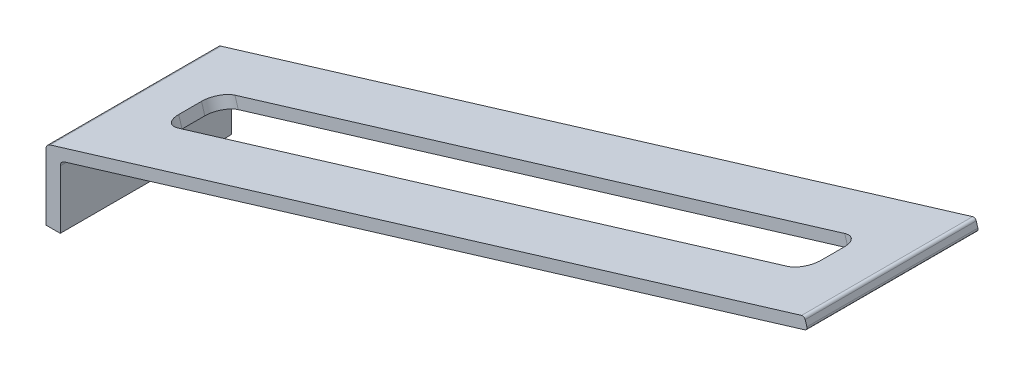
ISO-10303-21;
HEADER;
FILE_DESCRIPTION(('STEP AP214'),'2;1');
FILE_NAME('part.step','',(''),(''),'','','');
FILE_SCHEMA(('AUTOMOTIVE_DESIGN { 1 0 10303 214 1 1 1 1 }'));
ENDSEC;
DATA;
#1=APPLICATION_CONTEXT('core data for automotive mechanical design processes');
#2=APPLICATION_PROTOCOL_DEFINITION('international standard','automotive_design',2000,#1);
#3=PRODUCT_CONTEXT('',#1,'mechanical');
#4=PRODUCT('Part','Part','',(#3));
#5=PRODUCT_RELATED_PRODUCT_CATEGORY('part','',(#4));
#6=PRODUCT_DEFINITION_FORMATION('','',#4);
#7=PRODUCT_DEFINITION_CONTEXT('part definition',#1,'design');
#8=PRODUCT_DEFINITION('design','',#6,#7);
#9=PRODUCT_DEFINITION_SHAPE('','',#8);
#10=(LENGTH_UNIT() NAMED_UNIT(*) SI_UNIT(.MILLI.,.METRE.));
#11=(NAMED_UNIT(*) PLANE_ANGLE_UNIT() SI_UNIT($,.RADIAN.));
#12=(NAMED_UNIT(*) SI_UNIT($,.STERADIAN.) SOLID_ANGLE_UNIT());
#13=UNCERTAINTY_MEASURE_WITH_UNIT(LENGTH_MEASURE(1.E-05),#10,'distance_accuracy_value','');
#14=(GEOMETRIC_REPRESENTATION_CONTEXT(3) GLOBAL_UNCERTAINTY_ASSIGNED_CONTEXT((#13)) GLOBAL_UNIT_ASSIGNED_CONTEXT((#10,
#11,#12)) REPRESENTATION_CONTEXT('',''));
#15=CARTESIAN_POINT('',(0.,0.,0.));
#16=DIRECTION('',(0.,0.,1.));
#17=DIRECTION('',(1.,0.,0.));
#18=AXIS2_PLACEMENT_3D('',#15,#16,#17);
#19=CARTESIAN_POINT('',(-3.6,-1.16697015505413,3.));
#20=DIRECTION('',(1.,0.,0.));
#21=DIRECTION('',(0.,0.,-1.));
#22=AXIS2_PLACEMENT_3D('',#19,#20,#21);
#23=PLANE('',#22);
#24=DIRECTION('',(0.,1.,0.));
#25=VECTOR('',#24,1.);
#26=CARTESIAN_POINT('',(-3.6,-1.16697015505413,3.));
#27=LINE('',#26,#25);
#28=CARTESIAN_POINT('',(-3.6,-1.16697015505413,3.));
#29=VERTEX_POINT('',#28);
#30=CARTESIAN_POINT('',(-3.6,-2.19282032302755,3.));
#31=VERTEX_POINT('',#30);
#32=EDGE_CURVE('E111',#29,#31,#27,.F.);
#33=ORIENTED_EDGE('',*,*,#32,.T.);
#34=DIRECTION('',(0.,0.,1.));
#35=VECTOR('',#34,1.);
#36=CARTESIAN_POINT('',(-3.6,-2.19282032302755,3.));
#37=LINE('',#36,#35);
#38=CARTESIAN_POINT('',(-3.6,-2.19282032302755,0.));
#39=VERTEX_POINT('',#38);
#40=EDGE_CURVE('E219',#31,#39,#37,.F.);
#41=ORIENTED_EDGE('',*,*,#40,.T.);
#42=DIRECTION('',(0.,1.,0.));
#43=VECTOR('',#42,1.);
#44=CARTESIAN_POINT('',(-3.6,-1.16697015505413,0.));
#45=LINE('',#44,#43);
#46=CARTESIAN_POINT('',(-3.6,-1.16697015505413,0.));
#47=VERTEX_POINT('',#46);
#48=EDGE_CURVE('E225',#39,#47,#45,.T.);
#49=ORIENTED_EDGE('',*,*,#48,.T.);
#50=DIRECTION('',(0.,0.,-1.));
#51=VECTOR('',#50,1.);
#52=CARTESIAN_POINT('',(-3.6,-1.16697015505413,3.));
#53=LINE('',#52,#51);
#54=EDGE_CURVE('E211',#47,#29,#53,.F.);
#55=ORIENTED_EDGE('',*,*,#54,.T.);
#56=EDGE_LOOP('',(#33,#41,#49,#55));
#57=FACE_BOUND('',#56,.T.);
#58=ADVANCED_FACE('F17',(#57),#23,.T.);
#59=CARTESIAN_POINT('',(-3.85,-2.19282032302755,3.));
#60=DIRECTION('',(0.,1.,0.));
#61=DIRECTION('',(0.,0.,1.));
#62=AXIS2_PLACEMENT_3D('',#59,#60,#61);
#63=PLANE('',#62);
#64=ORIENTED_EDGE('',*,*,#40,.F.);
#65=DIRECTION('',(1.,0.,0.));
#66=VECTOR('',#65,1.);
#67=CARTESIAN_POINT('',(-3.85,-2.19282032302755,3.));
#68=LINE('',#67,#66);
#69=CARTESIAN_POINT('',(-3.85,-2.19282032302755,3.));
#70=VERTEX_POINT('',#69);
#71=EDGE_CURVE('E230',#70,#31,#68,.T.);
#72=ORIENTED_EDGE('',*,*,#71,.F.);
#73=DIRECTION('',(0.,0.,-1.));
#74=VECTOR('',#73,1.);
#75=CARTESIAN_POINT('',(-3.85,-2.19282032302755,3.));
#76=LINE('',#75,#74);
#77=CARTESIAN_POINT('',(-3.85,-2.19282032302755,0.));
#78=VERTEX_POINT('',#77);
#79=EDGE_CURVE('E289',#70,#78,#76,.T.);
#80=ORIENTED_EDGE('',*,*,#79,.T.);
#81=DIRECTION('',(1.,0.,0.));
#82=VECTOR('',#81,1.);
#83=CARTESIAN_POINT('',(-3.85,-2.19282032302755,0.));
#84=LINE('',#83,#82);
#85=EDGE_CURVE('E215',#39,#78,#84,.F.);
#86=ORIENTED_EDGE('',*,*,#85,.F.);
#87=EDGE_LOOP('',(#64,#72,#80,#86));
#88=FACE_BOUND('',#87,.T.);
#89=ADVANCED_FACE('F309',(#88),#63,.F.);
#90=CARTESIAN_POINT('',(-3.5,-1.16697015505413,3.));
#91=DIRECTION('',(0.,0.,-1.));
#92=DIRECTION('',(-1.,0.,0.));
#93=AXIS2_PLACEMENT_3D('',#90,#91,#92);
#94=CYLINDRICAL_SURFACE('',#93,0.0999999999999998);
#95=DIRECTION('',(0.,0.,1.));
#96=VECTOR('',#95,1.);
#97=CARTESIAN_POINT('',(-3.52904726426677,-1.07128182536542,3.));
#98=LINE('',#97,#96);
#99=CARTESIAN_POINT('',(-3.52904726426677,-1.07128182536542,0.));
#100=VERTEX_POINT('',#99);
#101=CARTESIAN_POINT('',(-3.52904726426677,-1.07128182536542,3.));
#102=VERTEX_POINT('',#101);
#103=EDGE_CURVE('E287',#100,#102,#98,.T.);
#104=ORIENTED_EDGE('',*,*,#103,.T.);
#105=CARTESIAN_POINT('',(-3.5,-1.16697015505413,3.));
#106=DIRECTION('',(0.,0.,-1.));
#107=DIRECTION('',(-1.,0.,0.));
#108=AXIS2_PLACEMENT_3D('',#105,#106,#107);
#109=CIRCLE('',#108,0.0999999999999998);
#110=EDGE_CURVE('E20',#29,#102,#109,.T.);
#111=ORIENTED_EDGE('',*,*,#110,.F.);
#112=ORIENTED_EDGE('',*,*,#54,.F.);
#113=CARTESIAN_POINT('',(-3.5,-1.16697015505413,0.));
#114=DIRECTION('',(0.,0.,-1.));
#115=DIRECTION('',(-1.,0.,0.));
#116=AXIS2_PLACEMENT_3D('',#113,#114,#115);
#117=CIRCLE('',#116,0.0999999999999998);
#118=EDGE_CURVE('E206',#100,#47,#117,.F.);
#119=ORIENTED_EDGE('',*,*,#118,.F.);
#120=EDGE_LOOP('',(#104,#111,#112,#119));
#121=FACE_BOUND('',#120,.T.);
#122=ADVANCED_FACE('F336',(#121),#94,.F.);
#123=CARTESIAN_POINT('',(9.44837064336018,2.92041171454448,3.));
#124=DIRECTION('',(0.,0.,-1.));
#125=DIRECTION('',(-1.,0.,0.));
#126=AXIS2_PLACEMENT_3D('',#123,#124,#125);
#127=CYLINDRICAL_SURFACE('',#126,0.0499999999999997);
#128=CARTESIAN_POINT('',(9.44837064336018,2.92041171454448,3.));
#129=DIRECTION('',(0.,0.,-1.));
#130=DIRECTION('',(-1.,0.,0.));
#131=AXIS2_PLACEMENT_3D('',#128,#129,#130);
#132=CIRCLE('',#131,0.0499999999999997);
#133=CARTESIAN_POINT('',(9.49621480820454,2.93493534667787,3.));
#134=VERTEX_POINT('',#133);
#135=CARTESIAN_POINT('',(9.46289427549357,2.87256754970012,3.));
#136=VERTEX_POINT('',#135);
#137=EDGE_CURVE('E203',#134,#136,#132,.T.);
#138=ORIENTED_EDGE('',*,*,#137,.T.);
#139=DIRECTION('',(0.,0.,1.));
#140=VECTOR('',#139,1.);
#141=CARTESIAN_POINT('',(9.46289427549357,2.87256754970012,3.));
#142=LINE('',#141,#140);
#143=CARTESIAN_POINT('',(9.46289427549357,2.87256754970012,0.));
#144=VERTEX_POINT('',#143);
#145=EDGE_CURVE('E286',#136,#144,#142,.F.);
#146=ORIENTED_EDGE('',*,*,#145,.T.);
#147=CARTESIAN_POINT('',(9.44837064336018,2.92041171454448,0.));
#148=DIRECTION('',(0.,0.,-1.));
#149=DIRECTION('',(-1.,0.,0.));
#150=AXIS2_PLACEMENT_3D('',#147,#148,#149);
#151=CIRCLE('',#150,0.0499999999999997);
#152=CARTESIAN_POINT('',(9.49621480820454,2.93493534667787,0.));
#153=VERTEX_POINT('',#152);
#154=EDGE_CURVE('E205',#144,#153,#151,.F.);
#155=ORIENTED_EDGE('',*,*,#154,.T.);
#156=DIRECTION('',(0.,0.,1.));
#157=VECTOR('',#156,1.);
#158=CARTESIAN_POINT('',(9.49621480820454,2.93493534667787,3.));
#159=LINE('',#158,#157);
#160=EDGE_CURVE('E202',#153,#134,#159,.T.);
#161=ORIENTED_EDGE('',*,*,#160,.T.);
#162=EDGE_LOOP('',(#138,#146,#155,#161));
#163=FACE_BOUND('',#162,.T.);
#164=ADVANCED_FACE('F329',(#163),#127,.T.);
#165=CARTESIAN_POINT('',(-3.85,-1.03384855104302,3.));
#166=DIRECTION('',(1.,0.,0.));
#167=DIRECTION('',(0.,0.,-1.));
#168=AXIS2_PLACEMENT_3D('',#165,#166,#167);
#169=PLANE('',#168);
#170=ORIENTED_EDGE('',*,*,#79,.F.);
#171=DIRECTION('',(0.,1.,0.));
#172=VECTOR('',#171,1.);
#173=CARTESIAN_POINT('',(-3.85,-1.03384855104302,3.));
#174=LINE('',#173,#172);
#175=CARTESIAN_POINT('',(-3.85,-1.03384855104302,3.));
#176=VERTEX_POINT('',#175);
#177=EDGE_CURVE('E116',#176,#70,#174,.F.);
#178=ORIENTED_EDGE('',*,*,#177,.F.);
#179=DIRECTION('',(0.,0.,-1.));
#180=VECTOR('',#179,1.);
#181=CARTESIAN_POINT('',(-3.85,-1.03384855104302,3.));
#182=LINE('',#181,#180);
#183=CARTESIAN_POINT('',(-3.85,-1.03384855104302,0.));
#184=VERTEX_POINT('',#183);
#185=EDGE_CURVE('E190',#184,#176,#182,.F.);
#186=ORIENTED_EDGE('',*,*,#185,.F.);
#187=DIRECTION('',(0.,1.,0.));
#188=VECTOR('',#187,1.);
#189=CARTESIAN_POINT('',(-3.85,-1.16697015505413,0.));
#190=LINE('',#189,#188);
#191=EDGE_CURVE('E191',#184,#78,#190,.F.);
#192=ORIENTED_EDGE('',*,*,#191,.T.);
#193=EDGE_LOOP('',(#170,#178,#186,#192));
#194=FACE_BOUND('',#193,.T.);
#195=ADVANCED_FACE('F314',(#194),#169,.F.);
#196=CARTESIAN_POINT('',(-3.52904726426677,-1.07128182536542,3.));
#197=DIRECTION('',(-0.290472642667745,0.956883296887147,0.));
#198=DIRECTION('',(-0.956883296887147,-0.290472642667745,0.));
#199=AXIS2_PLACEMENT_3D('',#196,#197,#198);
#200=PLANE('',#199);
#201=ORIENTED_EDGE('',*,*,#145,.F.);
#202=DIRECTION('',(0.956883296887147,0.290472642667744,0.));
#203=VECTOR('',#202,1.);
#204=CARTESIAN_POINT('',(-3.52904726426677,-1.07128182536542,3.));
#205=LINE('',#204,#203);
#206=EDGE_CURVE('E251',#102,#136,#205,.T.);
#207=ORIENTED_EDGE('',*,*,#206,.F.);
#208=ORIENTED_EDGE('',*,*,#103,.F.);
#209=DIRECTION('',(0.956883296887147,0.290472642667744,0.));
#210=VECTOR('',#209,1.);
#211=CARTESIAN_POINT('',(-3.52904726426677,-1.07128182536542,0.));
#212=LINE('',#211,#210);
#213=EDGE_CURVE('E267',#100,#144,#212,.T.);
#214=ORIENTED_EDGE('',*,*,#213,.T.);
#215=EDGE_LOOP('',(#201,#207,#208,#214));
#216=FACE_BOUND('',#215,.T.);
#217=CARTESIAN_POINT('',(8.21894598954028,2.49495311423206,1.7));
#218=DIRECTION('',(-0.290472642667744,0.956883296887148,0.));
#219=DIRECTION('',(-0.956883296887148,-0.290472642667744,0.));
#220=AXIS2_PLACEMENT_3D('',#217,#218,#219);
#221=CIRCLE('',#220,0.299999999999999);
#222=CARTESIAN_POINT('',(8.21894598954028,2.49495311423206,2.));
#223=VERTEX_POINT('',#222);
#224=CARTESIAN_POINT('',(8.50601097860642,2.58209490703238,1.7));
#225=VERTEX_POINT('',#224);
#226=EDGE_CURVE('E152',#223,#225,#221,.T.);
#227=ORIENTED_EDGE('',*,*,#226,.T.);
#228=DIRECTION('',(0.,0.,1.));
#229=VECTOR('',#228,1.);
#230=CARTESIAN_POINT('',(8.50601097860642,2.58209490703238,1.7));
#231=LINE('',#230,#229);
#232=CARTESIAN_POINT('',(8.50601097860642,2.58209490703238,1.3));
#233=VERTEX_POINT('',#232);
#234=EDGE_CURVE('E273',#225,#233,#231,.F.);
#235=ORIENTED_EDGE('',*,*,#234,.T.);
#236=CARTESIAN_POINT('',(8.21894598954028,2.49495311423206,1.3));
#237=DIRECTION('',(-0.290472642667744,0.956883296887148,0.));
#238=DIRECTION('',(-0.956883296887148,-0.290472642667744,0.));
#239=AXIS2_PLACEMENT_3D('',#236,#237,#238);
#240=CIRCLE('',#239,0.299999999999999);
#241=CARTESIAN_POINT('',(8.21894598954028,2.49495311423206,1.));
#242=VERTEX_POINT('',#241);
#243=EDGE_CURVE('E192',#233,#242,#240,.T.);
#244=ORIENTED_EDGE('',*,*,#243,.T.);
#245=DIRECTION('',(-0.956883296887147,-0.290472642667744,0.));
#246=VECTOR('',#245,1.);
#247=CARTESIAN_POINT('',(8.21894598954028,2.49495311423206,1.));
#248=LINE('',#247,#246);
#249=CARTESIAN_POINT('',(-2.47700444977993,-0.751922445263662,1.));
#250=VERTEX_POINT('',#249);
#251=EDGE_CURVE('E277',#242,#250,#248,.T.);
#252=ORIENTED_EDGE('',*,*,#251,.T.);
#253=CARTESIAN_POINT('',(-2.47700444977993,-0.751922445263662,1.3));
#254=DIRECTION('',(-0.290472642667744,0.956883296887148,0.));
#255=DIRECTION('',(-0.956883296887148,-0.290472642667744,0.));
#256=AXIS2_PLACEMENT_3D('',#253,#254,#255);
#257=CIRCLE('',#256,0.3);
#258=CARTESIAN_POINT('',(-2.76406943884608,-0.839064238063986,1.3));
#259=VERTEX_POINT('',#258);
#260=EDGE_CURVE('E196',#250,#259,#257,.T.);
#261=ORIENTED_EDGE('',*,*,#260,.T.);
#262=DIRECTION('',(0.,0.,1.));
#263=VECTOR('',#262,1.);
#264=CARTESIAN_POINT('',(-2.76406943884608,-0.839064238063986,1.3));
#265=LINE('',#264,#263);
#266=CARTESIAN_POINT('',(-2.76406943884608,-0.839064238063986,1.7));
#267=VERTEX_POINT('',#266);
#268=EDGE_CURVE('E280',#259,#267,#265,.T.);
#269=ORIENTED_EDGE('',*,*,#268,.T.);
#270=CARTESIAN_POINT('',(-2.47700444977993,-0.751922445263662,1.7));
#271=DIRECTION('',(-0.290472642667744,0.956883296887148,0.));
#272=DIRECTION('',(-0.956883296887148,-0.290472642667744,0.));
#273=AXIS2_PLACEMENT_3D('',#270,#271,#272);
#274=CIRCLE('',#273,0.3);
#275=CARTESIAN_POINT('',(-2.47700444977993,-0.751922445263662,2.));
#276=VERTEX_POINT('',#275);
#277=EDGE_CURVE('E155',#267,#276,#274,.T.);
#278=ORIENTED_EDGE('',*,*,#277,.T.);
#279=DIRECTION('',(0.956883296887147,0.290472642667744,0.));
#280=VECTOR('',#279,1.);
#281=CARTESIAN_POINT('',(-2.47700444977993,-0.751922445263662,2.));
#282=LINE('',#281,#280);
#283=EDGE_CURVE('E156',#276,#223,#282,.T.);
#284=ORIENTED_EDGE('',*,*,#283,.T.);
#285=EDGE_LOOP('',(#227,#235,#244,#252,#261,#269,#278,#284));
#286=FACE_BOUND('',#285,.T.);
#287=ADVANCED_FACE('F333',(#216,#286),#200,.F.);
#288=CARTESIAN_POINT('',(9.49621480820454,2.93493534667787,3.));
#289=DIRECTION('',(-0.956883296887148,-0.290472642667743,0.));
#290=DIRECTION('',(0.290472642667743,-0.956883296887148,0.));
#291=AXIS2_PLACEMENT_3D('',#288,#289,#290);
#292=PLANE('',#291);
#293=DIRECTION('',(0.,0.,-1.));
#294=VECTOR('',#293,1.);
#295=CARTESIAN_POINT('',(9.46716754393776,3.03062367636658,3.));
#296=LINE('',#295,#294);
#297=CARTESIAN_POINT('',(9.46716754393776,3.03062367636658,3.));
#298=VERTEX_POINT('',#297);
#299=CARTESIAN_POINT('',(9.46716754393776,3.03062367636658,0.));
#300=VERTEX_POINT('',#299);
#301=EDGE_CURVE('E173',#298,#300,#296,.T.);
#302=ORIENTED_EDGE('',*,*,#301,.F.);
#303=DIRECTION('',(-0.290472642667758,0.956883296887143,0.));
#304=VECTOR('',#303,1.);
#305=CARTESIAN_POINT('',(9.49621480820454,2.93493534667787,3.));
#306=LINE('',#305,#304);
#307=EDGE_CURVE('E186',#134,#298,#306,.T.);
#308=ORIENTED_EDGE('',*,*,#307,.F.);
#309=ORIENTED_EDGE('',*,*,#160,.F.);
#310=DIRECTION('',(-0.290472642667758,0.956883296887143,0.));
#311=VECTOR('',#310,1.);
#312=CARTESIAN_POINT('',(9.49621480820454,2.93493534667787,0.));
#313=LINE('',#312,#311);
#314=EDGE_CURVE('E263',#153,#300,#313,.T.);
#315=ORIENTED_EDGE('',*,*,#314,.T.);
#316=EDGE_LOOP('',(#302,#308,#309,#315));
#317=FACE_BOUND('',#316,.T.);
#318=ADVANCED_FACE('F325',(#317),#292,.F.);
#319=CARTESIAN_POINT('',(9.20655297461061,-0.758450095184247,1.7));
#320=DIRECTION('',(-0.290472642667744,0.956883296887148,0.));
#321=DIRECTION('',(-0.956883296887148,-0.290472642667744,0.));
#322=AXIS2_PLACEMENT_3D('',#319,#320,#321);
#323=CYLINDRICAL_SURFACE('',#322,0.299999999999999);
#324=CARTESIAN_POINT('',(8.16085146100673,2.68632977360949,1.7));
#325=DIRECTION('',(-0.290472642667744,0.956883296887148,0.));
#326=DIRECTION('',(-0.956883296887148,-0.290472642667744,0.));
#327=AXIS2_PLACEMENT_3D('',#324,#325,#326);
#328=CIRCLE('',#327,0.299999999999999);
#329=CARTESIAN_POINT('',(8.44791645007287,2.77347156640981,1.7));
#330=VERTEX_POINT('',#329);
#331=CARTESIAN_POINT('',(8.16085146100673,2.68632977360949,2.));
#332=VERTEX_POINT('',#331);
#333=EDGE_CURVE('E145',#330,#332,#328,.F.);
#334=ORIENTED_EDGE('',*,*,#333,.F.);
#335=DIRECTION('',(-0.290472642667744,0.956883296887147,0.));
#336=VECTOR('',#335,1.);
#337=CARTESIAN_POINT('',(9.49361796367676,-0.671308302383923,1.7));
#338=LINE('',#337,#336);
#339=EDGE_CURVE('E270',#330,#225,#338,.F.);
#340=ORIENTED_EDGE('',*,*,#339,.T.);
#341=ORIENTED_EDGE('',*,*,#226,.F.);
#342=DIRECTION('',(-0.290472642667751,0.956883296887145,0.));
#343=VECTOR('',#342,1.);
#344=CARTESIAN_POINT('',(8.21894598954028,2.49495311423206,2.));
#345=LINE('',#344,#343);
#346=EDGE_CURVE('E149',#223,#332,#345,.T.);
#347=ORIENTED_EDGE('',*,*,#346,.T.);
#348=EDGE_LOOP('',(#334,#340,#341,#347));
#349=FACE_BOUND('',#348,.T.);
#350=ADVANCED_FACE('F151',(#349),#323,.F.);
#351=CARTESIAN_POINT('',(-1.4893974647096,-4.00532565467996,2.));
#352=DIRECTION('',(0.,0.,1.));
#353=DIRECTION('',(1.,0.,0.));
#354=AXIS2_PLACEMENT_3D('',#351,#352,#353);
#355=PLANE('',#354);
#356=DIRECTION('',(-0.956883296887147,-0.290472642667744,0.));
#357=VECTOR('',#356,1.);
#358=CARTESIAN_POINT('',(-0.0580945285335493,0.191376659377429,2.));
#359=LINE('',#358,#357);
#360=CARTESIAN_POINT('',(-2.53509897831348,-0.560545785886232,2.));
#361=VERTEX_POINT('',#360);
#362=EDGE_CURVE('E159',#332,#361,#359,.T.);
#363=ORIENTED_EDGE('',*,*,#362,.F.);
#364=ORIENTED_EDGE('',*,*,#346,.F.);
#365=ORIENTED_EDGE('',*,*,#283,.F.);
#366=DIRECTION('',(-0.290472642667744,0.956883296887148,0.));
#367=VECTOR('',#366,1.);
#368=CARTESIAN_POINT('',(-1.4893974647096,-4.00532565467996,2.));
#369=LINE('',#368,#367);
#370=EDGE_CURVE('E162',#276,#361,#369,.T.);
#371=ORIENTED_EDGE('',*,*,#370,.T.);
#372=EDGE_LOOP('',(#363,#364,#365,#371));
#373=FACE_BOUND('',#372,.T.);
#374=ADVANCED_FACE('F160',(#373),#355,.F.);
#375=CARTESIAN_POINT('',(-1.4893974647096,-4.00532565467996,1.7));
#376=DIRECTION('',(-0.290472642667744,0.956883296887148,0.));
#377=DIRECTION('',(-0.956883296887148,-0.290472642667744,0.));
#378=AXIS2_PLACEMENT_3D('',#375,#376,#377);
#379=CYLINDRICAL_SURFACE('',#378,0.3);
#380=CARTESIAN_POINT('',(-2.53509897831348,-0.560545785886232,1.7));
#381=DIRECTION('',(-0.290472642667744,0.956883296887148,0.));
#382=DIRECTION('',(-0.956883296887148,-0.290472642667744,0.));
#383=AXIS2_PLACEMENT_3D('',#380,#381,#382);
#384=CIRCLE('',#383,0.3);
#385=CARTESIAN_POINT('',(-2.82216396737963,-0.647687578686556,1.7));
#386=VERTEX_POINT('',#385);
#387=EDGE_CURVE('E166',#361,#386,#384,.F.);
#388=ORIENTED_EDGE('',*,*,#387,.F.);
#389=ORIENTED_EDGE('',*,*,#370,.F.);
#390=ORIENTED_EDGE('',*,*,#277,.F.);
#391=DIRECTION('',(0.290472642667744,-0.956883296887147,0.));
#392=VECTOR('',#391,1.);
#393=CARTESIAN_POINT('',(-1.77646245377575,-4.09246744748029,1.7));
#394=LINE('',#393,#392);
#395=EDGE_CURVE('E199',#267,#386,#394,.F.);
#396=ORIENTED_EDGE('',*,*,#395,.T.);
#397=EDGE_LOOP('',(#388,#389,#390,#396));
#398=FACE_BOUND('',#397,.T.);
#399=ADVANCED_FACE('F377',(#398),#379,.F.);
#400=CARTESIAN_POINT('',(-1.77646245377575,-4.09246744748029,1.3));
#401=DIRECTION('',(-0.956883296887147,-0.290472642667744,0.));
#402=DIRECTION('',(0.290472642667744,-0.956883296887147,0.));
#403=AXIS2_PLACEMENT_3D('',#400,#401,#402);
#404=PLANE('',#403);
#405=DIRECTION('',(0.,0.,1.));
#406=VECTOR('',#405,1.);
#407=CARTESIAN_POINT('',(-2.82216396737963,-0.647687578686557,3.));
#408=LINE('',#407,#406);
#409=CARTESIAN_POINT('',(-2.82216396737963,-0.647687578686556,1.3));
#410=VERTEX_POINT('',#409);
#411=EDGE_CURVE('E241',#386,#410,#408,.F.);
#412=ORIENTED_EDGE('',*,*,#411,.F.);
#413=ORIENTED_EDGE('',*,*,#395,.F.);
#414=ORIENTED_EDGE('',*,*,#268,.F.);
#415=DIRECTION('',(-0.290472642667744,0.956883296887148,0.));
#416=VECTOR('',#415,1.);
#417=CARTESIAN_POINT('',(-1.77646245377575,-4.09246744748029,1.3));
#418=LINE('',#417,#416);
#419=EDGE_CURVE('E198',#259,#410,#418,.T.);
#420=ORIENTED_EDGE('',*,*,#419,.T.);
#421=EDGE_LOOP('',(#412,#413,#414,#420));
#422=FACE_BOUND('',#421,.T.);
#423=ADVANCED_FACE('F373',(#422),#404,.F.);
#424=CARTESIAN_POINT('',(-1.4893974647096,-4.00532565467996,1.3));
#425=DIRECTION('',(-0.290472642667744,0.956883296887148,0.));
#426=DIRECTION('',(-0.956883296887148,-0.290472642667744,0.));
#427=AXIS2_PLACEMENT_3D('',#424,#425,#426);
#428=CYLINDRICAL_SURFACE('',#427,0.3);
#429=CARTESIAN_POINT('',(-2.53509897831348,-0.560545785886232,1.3));
#430=DIRECTION('',(-0.290472642667744,0.956883296887148,0.));
#431=DIRECTION('',(-0.956883296887148,-0.290472642667744,0.));
#432=AXIS2_PLACEMENT_3D('',#429,#430,#431);
#433=CIRCLE('',#432,0.3);
#434=CARTESIAN_POINT('',(-2.53509897831348,-0.560545785886233,1.));
#435=VERTEX_POINT('',#434);
#436=EDGE_CURVE('E239',#410,#435,#433,.F.);
#437=ORIENTED_EDGE('',*,*,#436,.F.);
#438=ORIENTED_EDGE('',*,*,#419,.F.);
#439=ORIENTED_EDGE('',*,*,#260,.F.);
#440=DIRECTION('',(-0.290472642667743,0.956883296887148,0.));
#441=VECTOR('',#440,1.);
#442=CARTESIAN_POINT('',(-2.47700444977993,-0.751922445263662,1.));
#443=LINE('',#442,#441);
#444=EDGE_CURVE('E195',#250,#435,#443,.T.);
#445=ORIENTED_EDGE('',*,*,#444,.T.);
#446=EDGE_LOOP('',(#437,#438,#439,#445));
#447=FACE_BOUND('',#446,.T.);
#448=ADVANCED_FACE('F369',(#447),#428,.F.);
#449=CARTESIAN_POINT('',(9.20655297461061,-0.758450095184247,1.));
#450=DIRECTION('',(0.,0.,-1.));
#451=DIRECTION('',(-1.,0.,0.));
#452=AXIS2_PLACEMENT_3D('',#449,#450,#451);
#453=PLANE('',#452);
#454=DIRECTION('',(-0.956883296887147,-0.290472642667744,0.));
#455=VECTOR('',#454,1.);
#456=CARTESIAN_POINT('',(-0.0580945285335493,0.191376659377429,1.));
#457=LINE('',#456,#455);
#458=CARTESIAN_POINT('',(8.16085146100673,2.68632977360949,1.));
#459=VERTEX_POINT('',#458);
#460=EDGE_CURVE('E238',#435,#459,#457,.F.);
#461=ORIENTED_EDGE('',*,*,#460,.F.);
#462=ORIENTED_EDGE('',*,*,#444,.F.);
#463=ORIENTED_EDGE('',*,*,#251,.F.);
#464=DIRECTION('',(-0.290472642667744,0.956883296887148,0.));
#465=VECTOR('',#464,1.);
#466=CARTESIAN_POINT('',(9.20655297461061,-0.758450095184247,1.));
#467=LINE('',#466,#465);
#468=EDGE_CURVE('E194',#242,#459,#467,.T.);
#469=ORIENTED_EDGE('',*,*,#468,.T.);
#470=EDGE_LOOP('',(#461,#462,#463,#469));
#471=FACE_BOUND('',#470,.T.);
#472=ADVANCED_FACE('F365',(#471),#453,.F.);
#473=CARTESIAN_POINT('',(9.20655297461061,-0.758450095184247,1.3));
#474=DIRECTION('',(-0.290472642667744,0.956883296887148,0.));
#475=DIRECTION('',(-0.956883296887148,-0.290472642667744,0.));
#476=AXIS2_PLACEMENT_3D('',#473,#474,#475);
#477=CYLINDRICAL_SURFACE('',#476,0.299999999999999);
#478=CARTESIAN_POINT('',(8.16085146100673,2.68632977360949,1.3));
#479=DIRECTION('',(-0.290472642667744,0.956883296887148,0.));
#480=DIRECTION('',(-0.956883296887148,-0.290472642667744,0.));
#481=AXIS2_PLACEMENT_3D('',#478,#479,#480);
#482=CIRCLE('',#481,0.299999999999999);
#483=CARTESIAN_POINT('',(8.44791645007287,2.77347156640981,1.3));
#484=VERTEX_POINT('',#483);
#485=EDGE_CURVE('E237',#459,#484,#482,.F.);
#486=ORIENTED_EDGE('',*,*,#485,.F.);
#487=ORIENTED_EDGE('',*,*,#468,.F.);
#488=ORIENTED_EDGE('',*,*,#243,.F.);
#489=DIRECTION('',(-0.290472642667744,0.956883296887147,0.));
#490=VECTOR('',#489,1.);
#491=CARTESIAN_POINT('',(9.49361796367676,-0.671308302383923,1.3));
#492=LINE('',#491,#490);
#493=EDGE_CURVE('E271',#233,#484,#492,.T.);
#494=ORIENTED_EDGE('',*,*,#493,.T.);
#495=EDGE_LOOP('',(#486,#487,#488,#494));
#496=FACE_BOUND('',#495,.T.);
#497=ADVANCED_FACE('F361',(#496),#477,.F.);
#498=CARTESIAN_POINT('',(9.49361796367676,-0.671308302383923,1.7));
#499=DIRECTION('',(0.956883296887147,0.290472642667744,0.));
#500=DIRECTION('',(-0.290472642667744,0.956883296887147,0.));
#501=AXIS2_PLACEMENT_3D('',#498,#499,#500);
#502=PLANE('',#501);
#503=DIRECTION('',(0.,0.,1.));
#504=VECTOR('',#503,1.);
#505=CARTESIAN_POINT('',(8.44791645007287,2.77347156640981,3.));
#506=LINE('',#505,#504);
#507=EDGE_CURVE('E172',#484,#330,#506,.T.);
#508=ORIENTED_EDGE('',*,*,#507,.F.);
#509=ORIENTED_EDGE('',*,*,#493,.F.);
#510=ORIENTED_EDGE('',*,*,#234,.F.);
#511=ORIENTED_EDGE('',*,*,#339,.F.);
#512=EDGE_LOOP('',(#508,#509,#510,#511));
#513=FACE_BOUND('',#512,.T.);
#514=ADVANCED_FACE('F358',(#513),#502,.F.);
#515=CARTESIAN_POINT('',(-3.5,-1.16697015505413,0.));
#516=DIRECTION('',(0.,0.,1.));
#517=DIRECTION('',(1.,0.,0.));
#518=AXIS2_PLACEMENT_3D('',#515,#516,#517);
#519=PLANE('',#518);
#520=ORIENTED_EDGE('',*,*,#48,.F.);
#521=ORIENTED_EDGE('',*,*,#85,.T.);
#522=ORIENTED_EDGE('',*,*,#191,.F.);
#523=CARTESIAN_POINT('',(-3.75,-1.03384855104302,0.));
#524=DIRECTION('',(0.,0.,-1.));
#525=DIRECTION('',(-1.,0.,0.));
#526=AXIS2_PLACEMENT_3D('',#523,#524,#525);
#527=CIRCLE('',#526,0.0999999999999998);
#528=CARTESIAN_POINT('',(-3.77904726426677,-0.938160221354301,0.));
#529=VERTEX_POINT('',#528);
#530=EDGE_CURVE('E187',#529,#184,#527,.F.);
#531=ORIENTED_EDGE('',*,*,#530,.F.);
#532=DIRECTION('',(-0.956883296887147,-0.290472642667744,0.));
#533=VECTOR('',#532,1.);
#534=CARTESIAN_POINT('',(-0.0580945285335493,0.191376659377429,0.));
#535=LINE('',#534,#533);
#536=CARTESIAN_POINT('',(9.40479974696002,3.06394420907755,0.));
#537=VERTEX_POINT('',#536);
#538=EDGE_CURVE('E256',#537,#529,#535,.T.);
#539=ORIENTED_EDGE('',*,*,#538,.F.);
#540=CARTESIAN_POINT('',(9.41932337909341,3.01610004423319,0.));
#541=DIRECTION('',(0.,0.,-1.));
#542=DIRECTION('',(-1.,0.,0.));
#543=AXIS2_PLACEMENT_3D('',#540,#541,#542);
#544=CIRCLE('',#543,0.0499999999999997);
#545=EDGE_CURVE('E181',#300,#537,#544,.F.);
#546=ORIENTED_EDGE('',*,*,#545,.F.);
#547=ORIENTED_EDGE('',*,*,#314,.F.);
#548=ORIENTED_EDGE('',*,*,#154,.F.);
#549=ORIENTED_EDGE('',*,*,#213,.F.);
#550=ORIENTED_EDGE('',*,*,#118,.T.);
#551=EDGE_LOOP('',(#520,#521,#522,#531,#539,#546,#547,#548,#549,#550));
#552=FACE_BOUND('',#551,.T.);
#553=ADVANCED_FACE('F310',(#552),#519,.F.);
#554=CARTESIAN_POINT('',(-3.75,-1.03384855104302,3.));
#555=DIRECTION('',(0.,0.,-1.));
#556=DIRECTION('',(-1.,0.,0.));
#557=AXIS2_PLACEMENT_3D('',#554,#555,#556);
#558=CYLINDRICAL_SURFACE('',#557,0.0999999999999998);
#559=CARTESIAN_POINT('',(-3.75,-1.03384855104302,3.));
#560=DIRECTION('',(0.,0.,-1.));
#561=DIRECTION('',(-1.,0.,0.));
#562=AXIS2_PLACEMENT_3D('',#559,#560,#561);
#563=CIRCLE('',#562,0.0999999999999998);
#564=CARTESIAN_POINT('',(-3.77904726426677,-0.938160221354301,3.));
#565=VERTEX_POINT('',#564);
#566=EDGE_CURVE('E184',#565,#176,#563,.F.);
#567=ORIENTED_EDGE('',*,*,#566,.F.);
#568=DIRECTION('',(0.,0.,1.));
#569=VECTOR('',#568,1.);
#570=CARTESIAN_POINT('',(-3.77904726426677,-0.938160221354301,3.));
#571=LINE('',#570,#569);
#572=EDGE_CURVE('E253',#529,#565,#571,.T.);
#573=ORIENTED_EDGE('',*,*,#572,.F.);
#574=ORIENTED_EDGE('',*,*,#530,.T.);
#575=ORIENTED_EDGE('',*,*,#185,.T.);
#576=EDGE_LOOP('',(#567,#573,#574,#575));
#577=FACE_BOUND('',#576,.T.);
#578=ADVANCED_FACE('F316',(#577),#558,.T.);
#579=CARTESIAN_POINT('',(-3.5,-1.16697015505413,3.));
#580=DIRECTION('',(0.,0.,1.));
#581=DIRECTION('',(1.,0.,0.));
#582=AXIS2_PLACEMENT_3D('',#579,#580,#581);
#583=PLANE('',#582);
#584=ORIENTED_EDGE('',*,*,#71,.T.);
#585=ORIENTED_EDGE('',*,*,#32,.F.);
#586=ORIENTED_EDGE('',*,*,#110,.T.);
#587=ORIENTED_EDGE('',*,*,#206,.T.);
#588=ORIENTED_EDGE('',*,*,#137,.F.);
#589=ORIENTED_EDGE('',*,*,#307,.T.);
#590=CARTESIAN_POINT('',(9.41932337909341,3.01610004423319,3.));
#591=DIRECTION('',(0.,0.,-1.));
#592=DIRECTION('',(-1.,0.,0.));
#593=AXIS2_PLACEMENT_3D('',#590,#591,#592);
#594=CIRCLE('',#593,0.0499999999999997);
#595=CARTESIAN_POINT('',(9.40479974696002,3.06394420907755,3.));
#596=VERTEX_POINT('',#595);
#597=EDGE_CURVE('E35',#596,#298,#594,.T.);
#598=ORIENTED_EDGE('',*,*,#597,.F.);
#599=DIRECTION('',(-0.956883296887147,-0.290472642667744,0.));
#600=VECTOR('',#599,1.);
#601=CARTESIAN_POINT('',(-0.0580945285335493,0.191376659377429,3.));
#602=LINE('',#601,#600);
#603=EDGE_CURVE('E26',#565,#596,#602,.F.);
#604=ORIENTED_EDGE('',*,*,#603,.F.);
#605=ORIENTED_EDGE('',*,*,#566,.T.);
#606=ORIENTED_EDGE('',*,*,#177,.T.);
#607=EDGE_LOOP('',(#584,#585,#586,#587,#588,#589,#598,#604,#605,#606));
#608=FACE_BOUND('',#607,.T.);
#609=ADVANCED_FACE('F304',(#608),#583,.T.);
#610=CARTESIAN_POINT('',(9.41932337909341,3.01610004423319,3.));
#611=DIRECTION('',(0.,0.,-1.));
#612=DIRECTION('',(-1.,0.,0.));
#613=AXIS2_PLACEMENT_3D('',#610,#611,#612);
#614=CYLINDRICAL_SURFACE('',#613,0.0499999999999997);
#615=ORIENTED_EDGE('',*,*,#597,.T.);
#616=ORIENTED_EDGE('',*,*,#301,.T.);
#617=ORIENTED_EDGE('',*,*,#545,.T.);
#618=DIRECTION('',(0.,0.,1.));
#619=VECTOR('',#618,1.);
#620=CARTESIAN_POINT('',(9.40479974696002,3.06394420907755,3.));
#621=LINE('',#620,#619);
#622=EDGE_CURVE('E11',#596,#537,#621,.F.);
#623=ORIENTED_EDGE('',*,*,#622,.F.);
#624=EDGE_LOOP('',(#615,#616,#617,#623));
#625=FACE_BOUND('',#624,.T.);
#626=ADVANCED_FACE('F321',(#625),#614,.T.);
#627=CARTESIAN_POINT('',(-0.0580945285335493,0.191376659377429,3.));
#628=DIRECTION('',(-0.290472642667744,0.956883296887147,0.));
#629=DIRECTION('',(-0.956883296887147,-0.290472642667744,0.));
#630=AXIS2_PLACEMENT_3D('',#627,#628,#629);
#631=PLANE('',#630);
#632=ORIENTED_EDGE('',*,*,#603,.T.);
#633=ORIENTED_EDGE('',*,*,#622,.T.);
#634=ORIENTED_EDGE('',*,*,#538,.T.);
#635=ORIENTED_EDGE('',*,*,#572,.T.);
#636=EDGE_LOOP('',(#632,#633,#634,#635));
#637=FACE_BOUND('',#636,.T.);
#638=ORIENTED_EDGE('',*,*,#485,.T.);
#639=ORIENTED_EDGE('',*,*,#507,.T.);
#640=ORIENTED_EDGE('',*,*,#333,.T.);
#641=ORIENTED_EDGE('',*,*,#362,.T.);
#642=ORIENTED_EDGE('',*,*,#387,.T.);
#643=ORIENTED_EDGE('',*,*,#411,.T.);
#644=ORIENTED_EDGE('',*,*,#436,.T.);
#645=ORIENTED_EDGE('',*,*,#460,.T.);
#646=EDGE_LOOP('',(#638,#639,#640,#641,#642,#643,#644,#645));
#647=FACE_BOUND('',#646,.T.);
#648=ADVANCED_FACE('F170',(#637,#647),#631,.T.);
#649=CLOSED_SHELL('',(#58,#89,#122,#164,#195,#287,#318,#350,#374,#399,#423,#448,#472,#497,#514,
#553,#578,#609,#626,#648));
#650=MANIFOLD_SOLID_BREP('B1',#649);
#651=ADVANCED_BREP_SHAPE_REPRESENTATION('',(#18,#650),#14);
#652=SHAPE_DEFINITION_REPRESENTATION(#9,#651);
ENDSEC;
END-ISO-10303-21;
